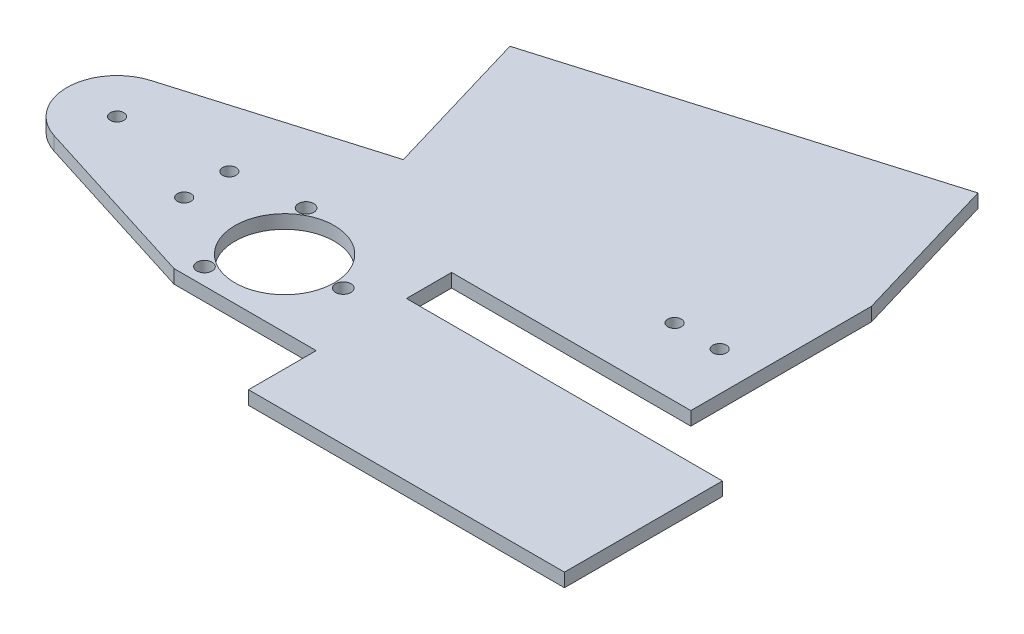
ISO-10303-21;
HEADER;
FILE_DESCRIPTION(('STEP AP214'),'2;1');
FILE_NAME('part.step','',(''),(''),'','','');
FILE_SCHEMA(('AUTOMOTIVE_DESIGN { 1 0 10303 214 1 1 1 1 }'));
ENDSEC;
DATA;
#1=APPLICATION_CONTEXT('core data for automotive mechanical design processes');
#2=APPLICATION_PROTOCOL_DEFINITION('international standard','automotive_design',2000,#1);
#3=PRODUCT_CONTEXT('',#1,'mechanical');
#4=PRODUCT('Part','Part','',(#3));
#5=PRODUCT_RELATED_PRODUCT_CATEGORY('part','',(#4));
#6=PRODUCT_DEFINITION_FORMATION('','',#4);
#7=PRODUCT_DEFINITION_CONTEXT('part definition',#1,'design');
#8=PRODUCT_DEFINITION('design','',#6,#7);
#9=PRODUCT_DEFINITION_SHAPE('','',#8);
#10=(LENGTH_UNIT() NAMED_UNIT(*) SI_UNIT(.MILLI.,.METRE.));
#11=(NAMED_UNIT(*) PLANE_ANGLE_UNIT() SI_UNIT($,.RADIAN.));
#12=(NAMED_UNIT(*) SI_UNIT($,.STERADIAN.) SOLID_ANGLE_UNIT());
#13=UNCERTAINTY_MEASURE_WITH_UNIT(LENGTH_MEASURE(1.E-05),#10,'distance_accuracy_value','');
#14=(GEOMETRIC_REPRESENTATION_CONTEXT(3) GLOBAL_UNCERTAINTY_ASSIGNED_CONTEXT((#13)) GLOBAL_UNIT_ASSIGNED_CONTEXT((#10,
#11,#12)) REPRESENTATION_CONTEXT('',''));
#15=CARTESIAN_POINT('',(0.,0.,0.));
#16=DIRECTION('',(0.,0.,1.));
#17=DIRECTION('',(1.,0.,0.));
#18=AXIS2_PLACEMENT_3D('',#15,#16,#17);
#19=CARTESIAN_POINT('',(-531.814143115865,-3.,-33.209876935339));
#20=DIRECTION('',(0.,-1.,0.));
#21=DIRECTION('',(0.,0.,-1.));
#22=AXIS2_PLACEMENT_3D('',#19,#20,#21);
#23=PLANE('',#22);
#24=CARTESIAN_POINT('',(-420.455543115792,-3.,-55.359876935335));
#25=DIRECTION('',(0.,-1.,0.));
#26=DIRECTION('',(0.,0.,-1.));
#27=AXIS2_PLACEMENT_3D('',#24,#25,#26);
#28=CIRCLE('',#27,1.49999999998116);
#29=CARTESIAN_POINT('',(-420.455543115792,-3.,-56.8598769353162));
#30=VERTEX_POINT('',#29);
#31=EDGE_CURVE('E588',#30,#30,#28,.T.);
#32=ORIENTED_EDGE('',*,*,#31,.F.);
#33=EDGE_LOOP('',(#32));
#34=FACE_BOUND('',#33,.T.);
#35=CARTESIAN_POINT('',(-493.344143115865,-3.,-36.6182071845329));
#36=DIRECTION('',(0.,-1.,0.));
#37=DIRECTION('',(0.,0.,-1.));
#38=AXIS2_PLACEMENT_3D('',#35,#36,#37);
#39=CIRCLE('',#38,1.70000000000367);
#40=CARTESIAN_POINT('',(-493.344143115865,-3.,-38.3182071845366));
#41=VERTEX_POINT('',#40);
#42=EDGE_CURVE('E608',#41,#41,#39,.T.);
#43=ORIENTED_EDGE('',*,*,#42,.F.);
#44=EDGE_LOOP('',(#43));
#45=FACE_BOUND('',#44,.T.);
#46=CARTESIAN_POINT('',(-486.844143115865,-3.,-25.359876935335));
#47=DIRECTION('',(0.,-1.,0.));
#48=DIRECTION('',(0.,0.,-1.));
#49=AXIS2_PLACEMENT_3D('',#46,#47,#48);
#50=CIRCLE('',#49,11.0000000000028);
#51=CARTESIAN_POINT('',(-486.844143115865,-3.,-36.3598769353378));
#52=VERTEX_POINT('',#51);
#53=EDGE_CURVE('E618',#52,#52,#50,.T.);
#54=ORIENTED_EDGE('',*,*,#53,.F.);
#55=EDGE_LOOP('',(#54));
#56=FACE_BOUND('',#55,.T.);
#57=CARTESIAN_POINT('',(-508.844143115865,-3.,-35.1134769353365));
#58=DIRECTION('',(0.,-1.,0.));
#59=DIRECTION('',(0.,0.,-1.));
#60=AXIS2_PLACEMENT_3D('',#57,#58,#59);
#61=CIRCLE('',#60,1.49999999999941);
#62=CARTESIAN_POINT('',(-508.844143115865,-3.,-36.6134769353359));
#63=VERTEX_POINT('',#62);
#64=EDGE_CURVE('E259',#63,#63,#61,.T.);
#65=ORIENTED_EDGE('',*,*,#64,.F.);
#66=EDGE_LOOP('',(#65));
#67=FACE_BOUND('',#66,.T.);
#68=CARTESIAN_POINT('',(-531.814143115865,-3.,-33.209876935339));
#69=DIRECTION('',(0.,-1.,0.));
#70=DIRECTION('',(0.,0.,-1.));
#71=AXIS2_PLACEMENT_3D('',#68,#69,#70);
#72=CIRCLE('',#71,11.13);
#73=CARTESIAN_POINT('',(-535.160059098475,-3.,-22.5947110752444));
#74=VERTEX_POINT('',#73);
#75=CARTESIAN_POINT('',(-534.975651854103,-3.,-43.8814167725906));
#76=VERTEX_POINT('',#75);
#77=EDGE_CURVE('E192',#74,#76,#72,.T.);
#78=ORIENTED_EDGE('',*,*,#77,.T.);
#79=DIRECTION('',(0.958808610714427,0.,-0.284052896517306));
#80=VECTOR('',#79,1.);
#81=CARTESIAN_POINT('',(-534.975651854103,-3.,-43.8814167725906));
#82=LINE('',#81,#80);
#83=CARTESIAN_POINT('',(-491.844143115865,-3.,-56.6593891972739));
#84=VERTEX_POINT('',#83);
#85=EDGE_CURVE('E116',#76,#84,#82,.T.);
#86=ORIENTED_EDGE('',*,*,#85,.T.);
#87=DIRECTION('',(-0.284052896517306,0.,-0.958808610714426));
#88=VECTOR('',#87,1.);
#89=CARTESIAN_POINT('',(-491.844143115865,-3.,-56.6593891972739));
#90=LINE('',#89,#88);
#91=CARTESIAN_POINT('',(-501.785994493971,-3.,-90.2176905722788));
#92=VERTEX_POINT('',#91);
#93=EDGE_CURVE('E228',#84,#92,#90,.T.);
#94=ORIENTED_EDGE('',*,*,#93,.T.);
#95=DIRECTION('',(0.958808610714426,0.,-0.284052896517308));
#96=VECTOR('',#95,1.);
#97=CARTESIAN_POINT('',(-501.785994493971,-3.,-90.2176905722788));
#98=LINE('',#97,#96);
#99=CARTESIAN_POINT('',(-421.785994493971,-3.,-113.91817831034));
#100=VERTEX_POINT('',#99);
#101=EDGE_CURVE('E263',#92,#100,#98,.T.);
#102=ORIENTED_EDGE('',*,*,#101,.T.);
#103=DIRECTION('',(0.284052896517309,0.,0.958808610714426));
#104=VECTOR('',#103,1.);
#105=CARTESIAN_POINT('',(-421.785994493971,-3.,-113.91817831034));
#106=LINE('',#105,#104);
#107=CARTESIAN_POINT('',(-411.844143115865,-3.,-80.359876935335));
#108=VERTEX_POINT('',#107);
#109=EDGE_CURVE('E265',#100,#108,#106,.T.);
#110=ORIENTED_EDGE('',*,*,#109,.T.);
#111=DIRECTION('',(0.,0.,1.));
#112=VECTOR('',#111,1.);
#113=CARTESIAN_POINT('',(-411.844143115865,-3.,-40.359876935335));
#114=LINE('',#113,#112);
#115=CARTESIAN_POINT('',(-411.844143115865,-3.,-40.359876935335));
#116=VERTEX_POINT('',#115);
#117=EDGE_CURVE('E267',#108,#116,#114,.T.);
#118=ORIENTED_EDGE('',*,*,#117,.T.);
#119=DIRECTION('',(-1.,0.,0.));
#120=VECTOR('',#119,1.);
#121=CARTESIAN_POINT('',(-464.844143115865,-3.,-40.359876935335));
#122=LINE('',#121,#120);
#123=CARTESIAN_POINT('',(-464.844143115865,-3.,-40.359876935335));
#124=VERTEX_POINT('',#123);
#125=EDGE_CURVE('E269',#116,#124,#122,.T.);
#126=ORIENTED_EDGE('',*,*,#125,.T.);
#127=DIRECTION('',(0.,0.,1.));
#128=VECTOR('',#127,1.);
#129=CARTESIAN_POINT('',(-464.844143115865,-3.,-30.359876935335));
#130=LINE('',#129,#128);
#131=CARTESIAN_POINT('',(-464.844143115865,-3.,-30.359876935335));
#132=VERTEX_POINT('',#131);
#133=EDGE_CURVE('E271',#124,#132,#130,.T.);
#134=ORIENTED_EDGE('',*,*,#133,.T.);
#135=DIRECTION('',(1.,0.,0.));
#136=VECTOR('',#135,1.);
#137=CARTESIAN_POINT('',(-464.844143115865,-3.,-30.359876935335));
#138=LINE('',#137,#136);
#139=CARTESIAN_POINT('',(-394.844143115865,-3.,-30.359876935335));
#140=VERTEX_POINT('',#139);
#141=EDGE_CURVE('E273',#132,#140,#138,.T.);
#142=ORIENTED_EDGE('',*,*,#141,.T.);
#143=DIRECTION('',(0.,0.,1.));
#144=VECTOR('',#143,1.);
#145=CARTESIAN_POINT('',(-394.844143115865,-3.,-30.359876935335));
#146=LINE('',#145,#144);
#147=CARTESIAN_POINT('',(-394.844143115865,-3.,4.640123064665));
#148=VERTEX_POINT('',#147);
#149=EDGE_CURVE('E275',#140,#148,#146,.T.);
#150=ORIENTED_EDGE('',*,*,#149,.T.);
#151=DIRECTION('',(-1.,0.,0.));
#152=VECTOR('',#151,1.);
#153=CARTESIAN_POINT('',(-464.844143115865,-3.,4.640123064665));
#154=LINE('',#153,#152);
#155=CARTESIAN_POINT('',(-464.844143115865,-3.,4.640123064665));
#156=VERTEX_POINT('',#155);
#157=EDGE_CURVE('E153',#148,#156,#154,.T.);
#158=ORIENTED_EDGE('',*,*,#157,.T.);
#159=DIRECTION('',(0.,0.,-1.));
#160=VECTOR('',#159,1.);
#161=CARTESIAN_POINT('',(-464.844143115865,-3.,-10.3598769353365));
#162=LINE('',#161,#160);
#163=CARTESIAN_POINT('',(-464.844143115865,-3.,-10.3598769353365));
#164=VERTEX_POINT('',#163);
#165=EDGE_CURVE('E147',#156,#164,#162,.T.);
#166=ORIENTED_EDGE('',*,*,#165,.T.);
#167=DIRECTION('',(-1.,0.,0.));
#168=VECTOR('',#167,1.);
#169=CARTESIAN_POINT('',(-464.844143115865,-3.,-10.3598769353365));
#170=LINE('',#169,#168);
#171=CARTESIAN_POINT('',(-496.344143115865,-3.,-10.3598769353343));
#172=VERTEX_POINT('',#171);
#173=EDGE_CURVE('E151',#164,#172,#170,.T.);
#174=ORIENTED_EDGE('',*,*,#173,.T.);
#175=DIRECTION('',(-0.953743563350786,0.,-0.300621382085417));
#176=VECTOR('',#175,1.);
#177=CARTESIAN_POINT('',(-496.344143115865,-3.,-10.3598769353343));
#178=LINE('',#177,#176);
#179=EDGE_CURVE('E55',#172,#74,#178,.T.);
#180=ORIENTED_EDGE('',*,*,#179,.T.);
#181=EDGE_LOOP('',(#78,#86,#94,#102,#110,#118,#126,#134,#142,#150,#158,#166,#174,#180));
#182=FACE_BOUND('',#181,.T.);
#183=CARTESIAN_POINT('',(-531.814143115865,-3.,-33.209876935339));
#184=DIRECTION('',(0.,-1.,0.));
#185=DIRECTION('',(0.,0.,-1.));
#186=AXIS2_PLACEMENT_3D('',#183,#184,#185);
#187=CIRCLE('',#186,1.50000000000103);
#188=CARTESIAN_POINT('',(-531.814143115865,-3.,-34.70987693534));
#189=VERTEX_POINT('',#188);
#190=EDGE_CURVE('E177',#189,#189,#187,.T.);
#191=ORIENTED_EDGE('',*,*,#190,.F.);
#192=EDGE_LOOP('',(#191));
#193=FACE_BOUND('',#192,.T.);
#194=CARTESIAN_POINT('',(-508.844143115865,-3.,-25.1134769353365));
#195=DIRECTION('',(0.,-1.,0.));
#196=DIRECTION('',(0.,0.,-1.));
#197=AXIS2_PLACEMENT_3D('',#194,#195,#196);
#198=CIRCLE('',#197,1.49999999999941);
#199=CARTESIAN_POINT('',(-508.844143115865,-3.,-26.6134769353359));
#200=VERTEX_POINT('',#199);
#201=EDGE_CURVE('E631',#200,#200,#198,.T.);
#202=ORIENTED_EDGE('',*,*,#201,.F.);
#203=EDGE_LOOP('',(#202));
#204=FACE_BOUND('',#203,.T.);
#205=CARTESIAN_POINT('',(-473.844143115865,-3.,-25.3598769353352));
#206=DIRECTION('',(0.,-1.,0.));
#207=DIRECTION('',(0.,0.,-1.));
#208=AXIS2_PLACEMENT_3D('',#205,#206,#207);
#209=CIRCLE('',#208,1.70000000000361);
#210=CARTESIAN_POINT('',(-473.844143115865,-3.,-27.0598769353388));
#211=VERTEX_POINT('',#210);
#212=EDGE_CURVE('E609',#211,#211,#209,.T.);
#213=ORIENTED_EDGE('',*,*,#212,.F.);
#214=EDGE_LOOP('',(#213));
#215=FACE_BOUND('',#214,.T.);
#216=CARTESIAN_POINT('',(-493.344143115865,-3.,-14.1015466861375));
#217=DIRECTION('',(0.,-1.,0.));
#218=DIRECTION('',(0.,0.,-1.));
#219=AXIS2_PLACEMENT_3D('',#216,#217,#218);
#220=CIRCLE('',#219,1.7000000000037);
#221=CARTESIAN_POINT('',(-493.344143115865,-3.,-15.8015466861413));
#222=VERTEX_POINT('',#221);
#223=EDGE_CURVE('E596',#222,#222,#220,.T.);
#224=ORIENTED_EDGE('',*,*,#223,.F.);
#225=EDGE_LOOP('',(#224));
#226=FACE_BOUND('',#225,.T.);
#227=CARTESIAN_POINT('',(-430.455543115792,-3.,-55.359876935335));
#228=DIRECTION('',(0.,-1.,0.));
#229=DIRECTION('',(0.,0.,-1.));
#230=AXIS2_PLACEMENT_3D('',#227,#228,#229);
#231=CIRCLE('',#230,1.49999999998116);
#232=CARTESIAN_POINT('',(-430.455543115792,-3.,-56.8598769353162));
#233=VERTEX_POINT('',#232);
#234=EDGE_CURVE('E577',#233,#233,#231,.T.);
#235=ORIENTED_EDGE('',*,*,#234,.F.);
#236=EDGE_LOOP('',(#235));
#237=FACE_BOUND('',#236,.T.);
#238=ADVANCED_FACE('F38',(#34,#45,#56,#67,#182,#193,#204,#215,#226,#237),#23,.T.);
#239=CARTESIAN_POINT('',(-531.814143115865,0.,-33.209876935339));
#240=DIRECTION('',(0.,-1.,0.));
#241=DIRECTION('',(0.,0.,-1.));
#242=AXIS2_PLACEMENT_3D('',#239,#240,#241);
#243=PLANE('',#242);
#244=CARTESIAN_POINT('',(-420.455543115792,0.,-55.359876935335));
#245=DIRECTION('',(0.,-1.,0.));
#246=DIRECTION('',(0.,0.,-1.));
#247=AXIS2_PLACEMENT_3D('',#244,#245,#246);
#248=CIRCLE('',#247,1.49999999998116);
#249=CARTESIAN_POINT('',(-420.455543115792,0.,-56.8598769353162));
#250=VERTEX_POINT('',#249);
#251=EDGE_CURVE('E584',#250,#250,#248,.T.);
#252=ORIENTED_EDGE('',*,*,#251,.T.);
#253=EDGE_LOOP('',(#252));
#254=FACE_BOUND('',#253,.T.);
#255=CARTESIAN_POINT('',(-493.344143115865,0.,-36.6182071845329));
#256=DIRECTION('',(0.,-1.,0.));
#257=DIRECTION('',(0.,0.,-1.));
#258=AXIS2_PLACEMENT_3D('',#255,#256,#257);
#259=CIRCLE('',#258,1.70000000000367);
#260=CARTESIAN_POINT('',(-493.344143115865,0.,-38.3182071845366));
#261=VERTEX_POINT('',#260);
#262=EDGE_CURVE('E602',#261,#261,#259,.T.);
#263=ORIENTED_EDGE('',*,*,#262,.T.);
#264=EDGE_LOOP('',(#263));
#265=FACE_BOUND('',#264,.T.);
#266=CARTESIAN_POINT('',(-486.844143115865,0.,-25.359876935335));
#267=DIRECTION('',(0.,-1.,0.));
#268=DIRECTION('',(0.,0.,-1.));
#269=AXIS2_PLACEMENT_3D('',#266,#267,#268);
#270=CIRCLE('',#269,11.0000000000028);
#271=CARTESIAN_POINT('',(-486.844143115865,0.,-36.3598769353378));
#272=VERTEX_POINT('',#271);
#273=EDGE_CURVE('E612',#272,#272,#270,.T.);
#274=ORIENTED_EDGE('',*,*,#273,.T.);
#275=EDGE_LOOP('',(#274));
#276=FACE_BOUND('',#275,.T.);
#277=CARTESIAN_POINT('',(-508.844143115865,0.,-35.1134769353365));
#278=DIRECTION('',(0.,-1.,0.));
#279=DIRECTION('',(0.,0.,-1.));
#280=AXIS2_PLACEMENT_3D('',#277,#278,#279);
#281=CIRCLE('',#280,1.49999999999941);
#282=CARTESIAN_POINT('',(-508.844143115865,0.,-36.6134769353359));
#283=VERTEX_POINT('',#282);
#284=EDGE_CURVE('E635',#283,#283,#281,.T.);
#285=ORIENTED_EDGE('',*,*,#284,.T.);
#286=EDGE_LOOP('',(#285));
#287=FACE_BOUND('',#286,.T.);
#288=CARTESIAN_POINT('',(-531.814143115865,0.,-33.209876935339));
#289=DIRECTION('',(0.,-1.,0.));
#290=DIRECTION('',(0.,0.,-1.));
#291=AXIS2_PLACEMENT_3D('',#288,#289,#290);
#292=CIRCLE('',#291,11.13);
#293=CARTESIAN_POINT('',(-535.160059098475,0.,-22.5947110752444));
#294=VERTEX_POINT('',#293);
#295=CARTESIAN_POINT('',(-534.975651854103,0.,-43.8814167725906));
#296=VERTEX_POINT('',#295);
#297=EDGE_CURVE('E171',#294,#296,#292,.T.);
#298=ORIENTED_EDGE('',*,*,#297,.F.);
#299=DIRECTION('',(-0.953743563350786,0.,-0.300621382085417));
#300=VECTOR('',#299,1.);
#301=CARTESIAN_POINT('',(-496.344143115865,0.,-10.3598769353343));
#302=LINE('',#301,#300);
#303=CARTESIAN_POINT('',(-496.344143115865,0.,-10.3598769353343));
#304=VERTEX_POINT('',#303);
#305=EDGE_CURVE('E108',#304,#294,#302,.T.);
#306=ORIENTED_EDGE('',*,*,#305,.F.);
#307=DIRECTION('',(-1.,0.,0.));
#308=VECTOR('',#307,1.);
#309=CARTESIAN_POINT('',(-464.844143115865,0.,-10.3598769353365));
#310=LINE('',#309,#308);
#311=CARTESIAN_POINT('',(-464.844143115865,0.,-10.3598769353365));
#312=VERTEX_POINT('',#311);
#313=EDGE_CURVE('E102',#312,#304,#310,.T.);
#314=ORIENTED_EDGE('',*,*,#313,.F.);
#315=DIRECTION('',(0.,0.,-1.));
#316=VECTOR('',#315,1.);
#317=CARTESIAN_POINT('',(-464.844143115865,0.,-10.3598769353365));
#318=LINE('',#317,#316);
#319=CARTESIAN_POINT('',(-464.844143115865,0.,4.640123064665));
#320=VERTEX_POINT('',#319);
#321=EDGE_CURVE('E161',#320,#312,#318,.T.);
#322=ORIENTED_EDGE('',*,*,#321,.F.);
#323=DIRECTION('',(-1.,0.,0.));
#324=VECTOR('',#323,1.);
#325=CARTESIAN_POINT('',(-464.844143115865,0.,4.640123064665));
#326=LINE('',#325,#324);
#327=CARTESIAN_POINT('',(-394.844143115865,0.,4.640123064665));
#328=VERTEX_POINT('',#327);
#329=EDGE_CURVE('E287',#328,#320,#326,.T.);
#330=ORIENTED_EDGE('',*,*,#329,.F.);
#331=DIRECTION('',(0.,0.,1.));
#332=VECTOR('',#331,1.);
#333=CARTESIAN_POINT('',(-394.844143115865,0.,-30.359876935335));
#334=LINE('',#333,#332);
#335=CARTESIAN_POINT('',(-394.844143115865,0.,-30.359876935335));
#336=VERTEX_POINT('',#335);
#337=EDGE_CURVE('E283',#336,#328,#334,.T.);
#338=ORIENTED_EDGE('',*,*,#337,.F.);
#339=DIRECTION('',(1.,0.,0.));
#340=VECTOR('',#339,1.);
#341=CARTESIAN_POINT('',(-464.844143115865,0.,-30.359876935335));
#342=LINE('',#341,#340);
#343=CARTESIAN_POINT('',(-464.844143115865,0.,-30.359876935335));
#344=VERTEX_POINT('',#343);
#345=EDGE_CURVE('E302',#344,#336,#342,.T.);
#346=ORIENTED_EDGE('',*,*,#345,.F.);
#347=DIRECTION('',(0.,0.,1.));
#348=VECTOR('',#347,1.);
#349=CARTESIAN_POINT('',(-464.844143115865,0.,-30.359876935335));
#350=LINE('',#349,#348);
#351=CARTESIAN_POINT('',(-464.844143115865,0.,-40.359876935335));
#352=VERTEX_POINT('',#351);
#353=EDGE_CURVE('E306',#352,#344,#350,.T.);
#354=ORIENTED_EDGE('',*,*,#353,.F.);
#355=DIRECTION('',(-1.,0.,0.));
#356=VECTOR('',#355,1.);
#357=CARTESIAN_POINT('',(-464.844143115865,0.,-40.359876935335));
#358=LINE('',#357,#356);
#359=CARTESIAN_POINT('',(-411.844143115865,0.,-40.359876935335));
#360=VERTEX_POINT('',#359);
#361=EDGE_CURVE('E310',#360,#352,#358,.T.);
#362=ORIENTED_EDGE('',*,*,#361,.F.);
#363=DIRECTION('',(0.,0.,1.));
#364=VECTOR('',#363,1.);
#365=CARTESIAN_POINT('',(-411.844143115865,0.,-40.359876935335));
#366=LINE('',#365,#364);
#367=CARTESIAN_POINT('',(-411.844143115865,0.,-80.359876935335));
#368=VERTEX_POINT('',#367);
#369=EDGE_CURVE('E315',#368,#360,#366,.T.);
#370=ORIENTED_EDGE('',*,*,#369,.F.);
#371=DIRECTION('',(0.284052896517309,0.,0.958808610714426));
#372=VECTOR('',#371,1.);
#373=CARTESIAN_POINT('',(-421.785994493971,0.,-113.91817831034));
#374=LINE('',#373,#372);
#375=CARTESIAN_POINT('',(-421.785994493971,0.,-113.91817831034));
#376=VERTEX_POINT('',#375);
#377=EDGE_CURVE('E239',#376,#368,#374,.T.);
#378=ORIENTED_EDGE('',*,*,#377,.F.);
#379=DIRECTION('',(0.958808610714426,0.,-0.284052896517308));
#380=VECTOR('',#379,1.);
#381=CARTESIAN_POINT('',(-501.785994493971,0.,-90.2176905722788));
#382=LINE('',#381,#380);
#383=CARTESIAN_POINT('',(-501.785994493971,0.,-90.2176905722788));
#384=VERTEX_POINT('',#383);
#385=EDGE_CURVE('E235',#384,#376,#382,.T.);
#386=ORIENTED_EDGE('',*,*,#385,.F.);
#387=DIRECTION('',(-0.284052896517306,0.,-0.958808610714426));
#388=VECTOR('',#387,1.);
#389=CARTESIAN_POINT('',(-491.844143115865,0.,-56.6593891972739));
#390=LINE('',#389,#388);
#391=CARTESIAN_POINT('',(-491.844143115865,0.,-56.6593891972739));
#392=VERTEX_POINT('',#391);
#393=EDGE_CURVE('E227',#392,#384,#390,.T.);
#394=ORIENTED_EDGE('',*,*,#393,.F.);
#395=DIRECTION('',(0.958808610714427,0.,-0.284052896517306));
#396=VECTOR('',#395,1.);
#397=CARTESIAN_POINT('',(-534.975651854103,0.,-43.8814167725906));
#398=LINE('',#397,#396);
#399=EDGE_CURVE('E176',#296,#392,#398,.T.);
#400=ORIENTED_EDGE('',*,*,#399,.F.);
#401=EDGE_LOOP('',(#298,#306,#314,#322,#330,#338,#346,#354,#362,#370,#378,#386,#394,#400));
#402=FACE_BOUND('',#401,.T.);
#403=CARTESIAN_POINT('',(-531.814143115865,0.,-33.209876935339));
#404=DIRECTION('',(0.,-1.,0.));
#405=DIRECTION('',(0.,0.,-1.));
#406=AXIS2_PLACEMENT_3D('',#403,#404,#405);
#407=CIRCLE('',#406,1.50000000000103);
#408=CARTESIAN_POINT('',(-531.814143115865,0.,-34.70987693534));
#409=VERTEX_POINT('',#408);
#410=EDGE_CURVE('E253',#409,#409,#407,.T.);
#411=ORIENTED_EDGE('',*,*,#410,.T.);
#412=EDGE_LOOP('',(#411));
#413=FACE_BOUND('',#412,.T.);
#414=CARTESIAN_POINT('',(-508.844143115865,0.,-25.1134769353365));
#415=DIRECTION('',(0.,-1.,0.));
#416=DIRECTION('',(0.,0.,-1.));
#417=AXIS2_PLACEMENT_3D('',#414,#415,#416);
#418=CIRCLE('',#417,1.49999999999941);
#419=CARTESIAN_POINT('',(-508.844143115865,0.,-26.6134769353359));
#420=VERTEX_POINT('',#419);
#421=EDGE_CURVE('E629',#420,#420,#418,.T.);
#422=ORIENTED_EDGE('',*,*,#421,.T.);
#423=EDGE_LOOP('',(#422));
#424=FACE_BOUND('',#423,.T.);
#425=CARTESIAN_POINT('',(-473.844143115865,0.,-25.3598769353352));
#426=DIRECTION('',(0.,-1.,0.));
#427=DIRECTION('',(0.,0.,-1.));
#428=AXIS2_PLACEMENT_3D('',#425,#426,#427);
#429=CIRCLE('',#428,1.70000000000361);
#430=CARTESIAN_POINT('',(-473.844143115865,0.,-27.0598769353388));
#431=VERTEX_POINT('',#430);
#432=EDGE_CURVE('E613',#431,#431,#429,.T.);
#433=ORIENTED_EDGE('',*,*,#432,.T.);
#434=EDGE_LOOP('',(#433));
#435=FACE_BOUND('',#434,.T.);
#436=CARTESIAN_POINT('',(-493.344143115865,0.,-14.1015466861375));
#437=DIRECTION('',(0.,-1.,0.));
#438=DIRECTION('',(0.,0.,-1.));
#439=AXIS2_PLACEMENT_3D('',#436,#437,#438);
#440=CIRCLE('',#439,1.7000000000037);
#441=CARTESIAN_POINT('',(-493.344143115865,0.,-15.8015466861413));
#442=VERTEX_POINT('',#441);
#443=EDGE_CURVE('E591',#442,#442,#440,.T.);
#444=ORIENTED_EDGE('',*,*,#443,.T.);
#445=EDGE_LOOP('',(#444));
#446=FACE_BOUND('',#445,.T.);
#447=CARTESIAN_POINT('',(-430.455543115792,0.,-55.359876935335));
#448=DIRECTION('',(0.,-1.,0.));
#449=DIRECTION('',(0.,0.,-1.));
#450=AXIS2_PLACEMENT_3D('',#447,#448,#449);
#451=CIRCLE('',#450,1.49999999998116);
#452=CARTESIAN_POINT('',(-430.455543115792,0.,-56.8598769353162));
#453=VERTEX_POINT('',#452);
#454=EDGE_CURVE('E580',#453,#453,#451,.T.);
#455=ORIENTED_EDGE('',*,*,#454,.T.);
#456=EDGE_LOOP('',(#455));
#457=FACE_BOUND('',#456,.T.);
#458=ADVANCED_FACE('F232',(#254,#265,#276,#287,#402,#413,#424,#435,#446,#457),#243,.F.);
#459=CARTESIAN_POINT('',(-531.814143115865,-3.,-33.209876935339));
#460=DIRECTION('',(0.,1.,0.));
#461=DIRECTION('',(0.,0.,1.));
#462=AXIS2_PLACEMENT_3D('',#459,#460,#461);
#463=CYLINDRICAL_SURFACE('',#462,11.13);
#464=ORIENTED_EDGE('',*,*,#297,.T.);
#465=DIRECTION('',(0.,1.,0.));
#466=VECTOR('',#465,1.);
#467=CARTESIAN_POINT('',(-534.975651854103,-3.,-43.8814167725906));
#468=LINE('',#467,#466);
#469=EDGE_CURVE('E12',#76,#296,#468,.T.);
#470=ORIENTED_EDGE('',*,*,#469,.F.);
#471=ORIENTED_EDGE('',*,*,#77,.F.);
#472=DIRECTION('',(0.,1.,0.));
#473=VECTOR('',#472,1.);
#474=CARTESIAN_POINT('',(-535.160059098475,-3.,-22.5947110752444));
#475=LINE('',#474,#473);
#476=EDGE_CURVE('E167',#74,#294,#475,.T.);
#477=ORIENTED_EDGE('',*,*,#476,.T.);
#478=EDGE_LOOP('',(#464,#470,#471,#477));
#479=FACE_BOUND('',#478,.T.);
#480=ADVANCED_FACE('F40',(#479),#463,.T.);
#481=CARTESIAN_POINT('',(-534.975651854103,-3.,-43.8814167725906));
#482=DIRECTION('',(0.284052896517306,0.,0.958808610714426));
#483=DIRECTION('',(0.958808610714427,0.,-0.284052896517306));
#484=AXIS2_PLACEMENT_3D('',#481,#482,#483);
#485=PLANE('',#484);
#486=ORIENTED_EDGE('',*,*,#399,.T.);
#487=DIRECTION('',(0.,1.,0.));
#488=VECTOR('',#487,1.);
#489=CARTESIAN_POINT('',(-491.844143115865,-3.,-56.6593891972739));
#490=LINE('',#489,#488);
#491=EDGE_CURVE('E47',#84,#392,#490,.T.);
#492=ORIENTED_EDGE('',*,*,#491,.F.);
#493=ORIENTED_EDGE('',*,*,#85,.F.);
#494=ORIENTED_EDGE('',*,*,#469,.T.);
#495=EDGE_LOOP('',(#486,#492,#493,#494));
#496=FACE_BOUND('',#495,.T.);
#497=ADVANCED_FACE('F352',(#496),#485,.F.);
#498=CARTESIAN_POINT('',(-491.844143115865,-3.,-56.6593891972739));
#499=DIRECTION('',(0.958808610714426,0.,-0.284052896517306));
#500=DIRECTION('',(-0.284052896517306,0.,-0.958808610714427));
#501=AXIS2_PLACEMENT_3D('',#498,#499,#500);
#502=PLANE('',#501);
#503=ORIENTED_EDGE('',*,*,#393,.T.);
#504=DIRECTION('',(0.,1.,0.));
#505=VECTOR('',#504,1.);
#506=CARTESIAN_POINT('',(-501.785994493971,-3.,-90.2176905722788));
#507=LINE('',#506,#505);
#508=EDGE_CURVE('E219',#92,#384,#507,.T.);
#509=ORIENTED_EDGE('',*,*,#508,.F.);
#510=ORIENTED_EDGE('',*,*,#93,.F.);
#511=ORIENTED_EDGE('',*,*,#491,.T.);
#512=EDGE_LOOP('',(#503,#509,#510,#511));
#513=FACE_BOUND('',#512,.T.);
#514=ADVANCED_FACE('F225',(#513),#502,.F.);
#515=CARTESIAN_POINT('',(-501.785994493971,-3.,-90.2176905722788));
#516=DIRECTION('',(0.284052896517308,0.,0.958808610714426));
#517=DIRECTION('',(0.958808610714426,0.,-0.284052896517308));
#518=AXIS2_PLACEMENT_3D('',#515,#516,#517);
#519=PLANE('',#518);
#520=ORIENTED_EDGE('',*,*,#385,.T.);
#521=DIRECTION('',(0.,1.,0.));
#522=VECTOR('',#521,1.);
#523=CARTESIAN_POINT('',(-421.785994493971,-3.,-113.91817831034));
#524=LINE('',#523,#522);
#525=EDGE_CURVE('E216',#100,#376,#524,.T.);
#526=ORIENTED_EDGE('',*,*,#525,.F.);
#527=ORIENTED_EDGE('',*,*,#101,.F.);
#528=ORIENTED_EDGE('',*,*,#508,.T.);
#529=EDGE_LOOP('',(#520,#526,#527,#528));
#530=FACE_BOUND('',#529,.T.);
#531=ADVANCED_FACE('F344',(#530),#519,.F.);
#532=CARTESIAN_POINT('',(-421.785994493971,-3.,-113.91817831034));
#533=DIRECTION('',(-0.958808610714425,0.,0.284052896517309));
#534=DIRECTION('',(0.284052896517309,0.,0.958808610714426));
#535=AXIS2_PLACEMENT_3D('',#532,#533,#534);
#536=PLANE('',#535);
#537=ORIENTED_EDGE('',*,*,#377,.T.);
#538=DIRECTION('',(0.,1.,0.));
#539=VECTOR('',#538,1.);
#540=CARTESIAN_POINT('',(-411.844143115865,-3.,-80.359876935335));
#541=LINE('',#540,#539);
#542=EDGE_CURVE('E213',#108,#368,#541,.T.);
#543=ORIENTED_EDGE('',*,*,#542,.F.);
#544=ORIENTED_EDGE('',*,*,#109,.F.);
#545=ORIENTED_EDGE('',*,*,#525,.T.);
#546=EDGE_LOOP('',(#537,#543,#544,#545));
#547=FACE_BOUND('',#546,.T.);
#548=ADVANCED_FACE('F322',(#547),#536,.F.);
#549=CARTESIAN_POINT('',(-411.844143115865,-3.,-40.359876935335));
#550=DIRECTION('',(-1.,0.,0.));
#551=DIRECTION('',(0.,0.,1.));
#552=AXIS2_PLACEMENT_3D('',#549,#550,#551);
#553=PLANE('',#552);
#554=ORIENTED_EDGE('',*,*,#369,.T.);
#555=DIRECTION('',(0.,1.,0.));
#556=VECTOR('',#555,1.);
#557=CARTESIAN_POINT('',(-411.844143115865,-3.,-40.359876935335));
#558=LINE('',#557,#556);
#559=EDGE_CURVE('E210',#116,#360,#558,.T.);
#560=ORIENTED_EDGE('',*,*,#559,.F.);
#561=ORIENTED_EDGE('',*,*,#117,.F.);
#562=ORIENTED_EDGE('',*,*,#542,.T.);
#563=EDGE_LOOP('',(#554,#560,#561,#562));
#564=FACE_BOUND('',#563,.T.);
#565=ADVANCED_FACE('F328',(#564),#553,.F.);
#566=CARTESIAN_POINT('',(-464.844143115865,-3.,-40.359876935335));
#567=DIRECTION('',(0.,0.,-1.));
#568=DIRECTION('',(-1.,0.,0.));
#569=AXIS2_PLACEMENT_3D('',#566,#567,#568);
#570=PLANE('',#569);
#571=ORIENTED_EDGE('',*,*,#361,.T.);
#572=DIRECTION('',(0.,1.,0.));
#573=VECTOR('',#572,1.);
#574=CARTESIAN_POINT('',(-464.844143115865,-3.,-40.359876935335));
#575=LINE('',#574,#573);
#576=EDGE_CURVE('E207',#124,#352,#575,.T.);
#577=ORIENTED_EDGE('',*,*,#576,.F.);
#578=ORIENTED_EDGE('',*,*,#125,.F.);
#579=ORIENTED_EDGE('',*,*,#559,.T.);
#580=EDGE_LOOP('',(#571,#577,#578,#579));
#581=FACE_BOUND('',#580,.T.);
#582=ADVANCED_FACE('F336',(#581),#570,.F.);
#583=CARTESIAN_POINT('',(-464.844143115865,-3.,-30.359876935335));
#584=DIRECTION('',(-1.,0.,0.));
#585=DIRECTION('',(0.,0.,1.));
#586=AXIS2_PLACEMENT_3D('',#583,#584,#585);
#587=PLANE('',#586);
#588=ORIENTED_EDGE('',*,*,#353,.T.);
#589=DIRECTION('',(0.,1.,0.));
#590=VECTOR('',#589,1.);
#591=CARTESIAN_POINT('',(-464.844143115865,-3.,-30.359876935335));
#592=LINE('',#591,#590);
#593=EDGE_CURVE('E204',#132,#344,#592,.T.);
#594=ORIENTED_EDGE('',*,*,#593,.F.);
#595=ORIENTED_EDGE('',*,*,#133,.F.);
#596=ORIENTED_EDGE('',*,*,#576,.T.);
#597=EDGE_LOOP('',(#588,#594,#595,#596));
#598=FACE_BOUND('',#597,.T.);
#599=ADVANCED_FACE('F340',(#598),#587,.F.);
#600=CARTESIAN_POINT('',(-464.844143115865,-3.,-30.359876935335));
#601=DIRECTION('',(0.,0.,1.));
#602=DIRECTION('',(1.,0.,0.));
#603=AXIS2_PLACEMENT_3D('',#600,#601,#602);
#604=PLANE('',#603);
#605=ORIENTED_EDGE('',*,*,#345,.T.);
#606=DIRECTION('',(0.,1.,0.));
#607=VECTOR('',#606,1.);
#608=CARTESIAN_POINT('',(-394.844143115865,-3.,-30.359876935335));
#609=LINE('',#608,#607);
#610=EDGE_CURVE('E201',#140,#336,#609,.T.);
#611=ORIENTED_EDGE('',*,*,#610,.F.);
#612=ORIENTED_EDGE('',*,*,#141,.F.);
#613=ORIENTED_EDGE('',*,*,#593,.T.);
#614=EDGE_LOOP('',(#605,#611,#612,#613));
#615=FACE_BOUND('',#614,.T.);
#616=ADVANCED_FACE('F379',(#615),#604,.F.);
#617=CARTESIAN_POINT('',(-394.844143115865,-3.,-30.359876935335));
#618=DIRECTION('',(-1.,0.,0.));
#619=DIRECTION('',(0.,0.,1.));
#620=AXIS2_PLACEMENT_3D('',#617,#618,#619);
#621=PLANE('',#620);
#622=ORIENTED_EDGE('',*,*,#337,.T.);
#623=DIRECTION('',(0.,1.,0.));
#624=VECTOR('',#623,1.);
#625=CARTESIAN_POINT('',(-394.844143115865,-3.,4.640123064665));
#626=LINE('',#625,#624);
#627=EDGE_CURVE('E198',#148,#328,#626,.T.);
#628=ORIENTED_EDGE('',*,*,#627,.F.);
#629=ORIENTED_EDGE('',*,*,#149,.F.);
#630=ORIENTED_EDGE('',*,*,#610,.T.);
#631=EDGE_LOOP('',(#622,#628,#629,#630));
#632=FACE_BOUND('',#631,.T.);
#633=ADVANCED_FACE('F281',(#632),#621,.F.);
#634=CARTESIAN_POINT('',(-464.844143115865,-3.,4.640123064665));
#635=DIRECTION('',(0.,0.,-1.));
#636=DIRECTION('',(-1.,0.,0.));
#637=AXIS2_PLACEMENT_3D('',#634,#635,#636);
#638=PLANE('',#637);
#639=ORIENTED_EDGE('',*,*,#329,.T.);
#640=DIRECTION('',(0.,1.,0.));
#641=VECTOR('',#640,1.);
#642=CARTESIAN_POINT('',(-464.844143115865,-3.,4.640123064665));
#643=LINE('',#642,#641);
#644=EDGE_CURVE('E162',#156,#320,#643,.T.);
#645=ORIENTED_EDGE('',*,*,#644,.F.);
#646=ORIENTED_EDGE('',*,*,#157,.F.);
#647=ORIENTED_EDGE('',*,*,#627,.T.);
#648=EDGE_LOOP('',(#639,#645,#646,#647));
#649=FACE_BOUND('',#648,.T.);
#650=ADVANCED_FACE('F286',(#649),#638,.F.);
#651=CARTESIAN_POINT('',(-464.844143115865,-3.,-10.3598769353365));
#652=DIRECTION('',(1.,0.,0.));
#653=DIRECTION('',(0.,0.,-1.));
#654=AXIS2_PLACEMENT_3D('',#651,#652,#653);
#655=PLANE('',#654);
#656=ORIENTED_EDGE('',*,*,#321,.T.);
#657=DIRECTION('',(0.,1.,0.));
#658=VECTOR('',#657,1.);
#659=CARTESIAN_POINT('',(-464.844143115865,-3.,-10.3598769353365));
#660=LINE('',#659,#658);
#661=EDGE_CURVE('E158',#164,#312,#660,.T.);
#662=ORIENTED_EDGE('',*,*,#661,.F.);
#663=ORIENTED_EDGE('',*,*,#165,.F.);
#664=ORIENTED_EDGE('',*,*,#644,.T.);
#665=EDGE_LOOP('',(#656,#662,#663,#664));
#666=FACE_BOUND('',#665,.T.);
#667=ADVANCED_FACE('F159',(#666),#655,.F.);
#668=CARTESIAN_POINT('',(-464.844143115865,-3.,-10.3598769353365));
#669=DIRECTION('',(0.,0.,-1.));
#670=DIRECTION('',(-1.,0.,0.));
#671=AXIS2_PLACEMENT_3D('',#668,#669,#670);
#672=PLANE('',#671);
#673=ORIENTED_EDGE('',*,*,#313,.T.);
#674=DIRECTION('',(0.,1.,0.));
#675=VECTOR('',#674,1.);
#676=CARTESIAN_POINT('',(-496.344143115865,-3.,-10.3598769353343));
#677=LINE('',#676,#675);
#678=EDGE_CURVE('E163',#172,#304,#677,.T.);
#679=ORIENTED_EDGE('',*,*,#678,.F.);
#680=ORIENTED_EDGE('',*,*,#173,.F.);
#681=ORIENTED_EDGE('',*,*,#661,.T.);
#682=EDGE_LOOP('',(#673,#679,#680,#681));
#683=FACE_BOUND('',#682,.T.);
#684=ADVANCED_FACE('F165',(#683),#672,.F.);
#685=CARTESIAN_POINT('',(-496.344143115865,-3.,-10.3598769353343));
#686=DIRECTION('',(0.300621382085417,0.,-0.953743563350785));
#687=DIRECTION('',(-0.953743563350785,0.,-0.300621382085417));
#688=AXIS2_PLACEMENT_3D('',#685,#686,#687);
#689=PLANE('',#688);
#690=ORIENTED_EDGE('',*,*,#305,.T.);
#691=ORIENTED_EDGE('',*,*,#476,.F.);
#692=ORIENTED_EDGE('',*,*,#179,.F.);
#693=ORIENTED_EDGE('',*,*,#678,.T.);
#694=EDGE_LOOP('',(#690,#691,#692,#693));
#695=FACE_BOUND('',#694,.T.);
#696=ADVANCED_FACE('F368',(#695),#689,.F.);
#697=CARTESIAN_POINT('',(-531.814143115865,-3.,-33.209876935339));
#698=DIRECTION('',(0.,1.,0.));
#699=DIRECTION('',(0.,0.,1.));
#700=AXIS2_PLACEMENT_3D('',#697,#698,#699);
#701=CYLINDRICAL_SURFACE('',#700,1.50000000000103);
#702=ORIENTED_EDGE('',*,*,#190,.T.);
#703=EDGE_LOOP('',(#702));
#704=FACE_BOUND('',#703,.T.);
#705=ORIENTED_EDGE('',*,*,#410,.F.);
#706=EDGE_LOOP('',(#705));
#707=FACE_BOUND('',#706,.T.);
#708=ADVANCED_FACE('F365',(#704,#707),#701,.F.);
#709=CARTESIAN_POINT('',(-508.844143115865,-3.,-35.1134769353365));
#710=DIRECTION('',(0.,1.,0.));
#711=DIRECTION('',(0.,0.,1.));
#712=AXIS2_PLACEMENT_3D('',#709,#710,#711);
#713=CYLINDRICAL_SURFACE('',#712,1.49999999999941);
#714=ORIENTED_EDGE('',*,*,#64,.T.);
#715=EDGE_LOOP('',(#714));
#716=FACE_BOUND('',#715,.T.);
#717=ORIENTED_EDGE('',*,*,#284,.F.);
#718=EDGE_LOOP('',(#717));
#719=FACE_BOUND('',#718,.T.);
#720=ADVANCED_FACE('F430',(#716,#719),#713,.F.);
#721=CARTESIAN_POINT('',(-508.844143115865,-3.,-25.1134769353365));
#722=DIRECTION('',(0.,1.,0.));
#723=DIRECTION('',(0.,0.,1.));
#724=AXIS2_PLACEMENT_3D('',#721,#722,#723);
#725=CYLINDRICAL_SURFACE('',#724,1.49999999999941);
#726=ORIENTED_EDGE('',*,*,#201,.T.);
#727=EDGE_LOOP('',(#726));
#728=FACE_BOUND('',#727,.T.);
#729=ORIENTED_EDGE('',*,*,#421,.F.);
#730=EDGE_LOOP('',(#729));
#731=FACE_BOUND('',#730,.T.);
#732=ADVANCED_FACE('F437',(#728,#731),#725,.F.);
#733=CARTESIAN_POINT('',(-486.844143115865,-3.,-25.359876935335));
#734=DIRECTION('',(0.,1.,0.));
#735=DIRECTION('',(0.,0.,1.));
#736=AXIS2_PLACEMENT_3D('',#733,#734,#735);
#737=CYLINDRICAL_SURFACE('',#736,11.0000000000028);
#738=ORIENTED_EDGE('',*,*,#53,.T.);
#739=EDGE_LOOP('',(#738));
#740=FACE_BOUND('',#739,.T.);
#741=ORIENTED_EDGE('',*,*,#273,.F.);
#742=EDGE_LOOP('',(#741));
#743=FACE_BOUND('',#742,.T.);
#744=ADVANCED_FACE('F444',(#740,#743),#737,.F.);
#745=CARTESIAN_POINT('',(-473.844143115865,-3.,-25.3598769353352));
#746=DIRECTION('',(0.,1.,0.));
#747=DIRECTION('',(0.,0.,1.));
#748=AXIS2_PLACEMENT_3D('',#745,#746,#747);
#749=CYLINDRICAL_SURFACE('',#748,1.70000000000361);
#750=ORIENTED_EDGE('',*,*,#212,.T.);
#751=EDGE_LOOP('',(#750));
#752=FACE_BOUND('',#751,.T.);
#753=ORIENTED_EDGE('',*,*,#432,.F.);
#754=EDGE_LOOP('',(#753));
#755=FACE_BOUND('',#754,.T.);
#756=ADVANCED_FACE('F452',(#752,#755),#749,.F.);
#757=CARTESIAN_POINT('',(-493.344143115865,-3.,-36.6182071845329));
#758=DIRECTION('',(0.,1.,0.));
#759=DIRECTION('',(0.,0.,1.));
#760=AXIS2_PLACEMENT_3D('',#757,#758,#759);
#761=CYLINDRICAL_SURFACE('',#760,1.70000000000367);
#762=ORIENTED_EDGE('',*,*,#42,.T.);
#763=EDGE_LOOP('',(#762));
#764=FACE_BOUND('',#763,.T.);
#765=ORIENTED_EDGE('',*,*,#262,.F.);
#766=EDGE_LOOP('',(#765));
#767=FACE_BOUND('',#766,.T.);
#768=ADVANCED_FACE('F460',(#764,#767),#761,.F.);
#769=CARTESIAN_POINT('',(-493.344143115865,-3.,-14.1015466861375));
#770=DIRECTION('',(0.,1.,0.));
#771=DIRECTION('',(0.,0.,1.));
#772=AXIS2_PLACEMENT_3D('',#769,#770,#771);
#773=CYLINDRICAL_SURFACE('',#772,1.7000000000037);
#774=ORIENTED_EDGE('',*,*,#223,.T.);
#775=EDGE_LOOP('',(#774));
#776=FACE_BOUND('',#775,.T.);
#777=ORIENTED_EDGE('',*,*,#443,.F.);
#778=EDGE_LOOP('',(#777));
#779=FACE_BOUND('',#778,.T.);
#780=ADVANCED_FACE('F468',(#776,#779),#773,.F.);
#781=CARTESIAN_POINT('',(-420.455543115792,-3.,-55.359876935335));
#782=DIRECTION('',(0.,1.,0.));
#783=DIRECTION('',(0.,0.,1.));
#784=AXIS2_PLACEMENT_3D('',#781,#782,#783);
#785=CYLINDRICAL_SURFACE('',#784,1.49999999998116);
#786=ORIENTED_EDGE('',*,*,#31,.T.);
#787=EDGE_LOOP('',(#786));
#788=FACE_BOUND('',#787,.T.);
#789=ORIENTED_EDGE('',*,*,#251,.F.);
#790=EDGE_LOOP('',(#789));
#791=FACE_BOUND('',#790,.T.);
#792=ADVANCED_FACE('F476',(#788,#791),#785,.F.);
#793=CARTESIAN_POINT('',(-430.455543115792,-3.,-55.359876935335));
#794=DIRECTION('',(0.,1.,0.));
#795=DIRECTION('',(0.,0.,1.));
#796=AXIS2_PLACEMENT_3D('',#793,#794,#795);
#797=CYLINDRICAL_SURFACE('',#796,1.49999999998116);
#798=ORIENTED_EDGE('',*,*,#234,.T.);
#799=EDGE_LOOP('',(#798));
#800=FACE_BOUND('',#799,.T.);
#801=ORIENTED_EDGE('',*,*,#454,.F.);
#802=EDGE_LOOP('',(#801));
#803=FACE_BOUND('',#802,.T.);
#804=ADVANCED_FACE('F484',(#800,#803),#797,.F.);
#805=CLOSED_SHELL('',(#238,#458,#480,#497,#514,#531,#548,#565,#582,#599,#616,#633,#650,#667,
#684,#696,#708,#720,#732,#744,#756,#768,#780,#792,#804));
#806=MANIFOLD_SOLID_BREP('B2',#805);
#807=ADVANCED_BREP_SHAPE_REPRESENTATION('',(#18,#806),#14);
#808=SHAPE_DEFINITION_REPRESENTATION(#9,#807);
ENDSEC;
END-ISO-10303-21;
